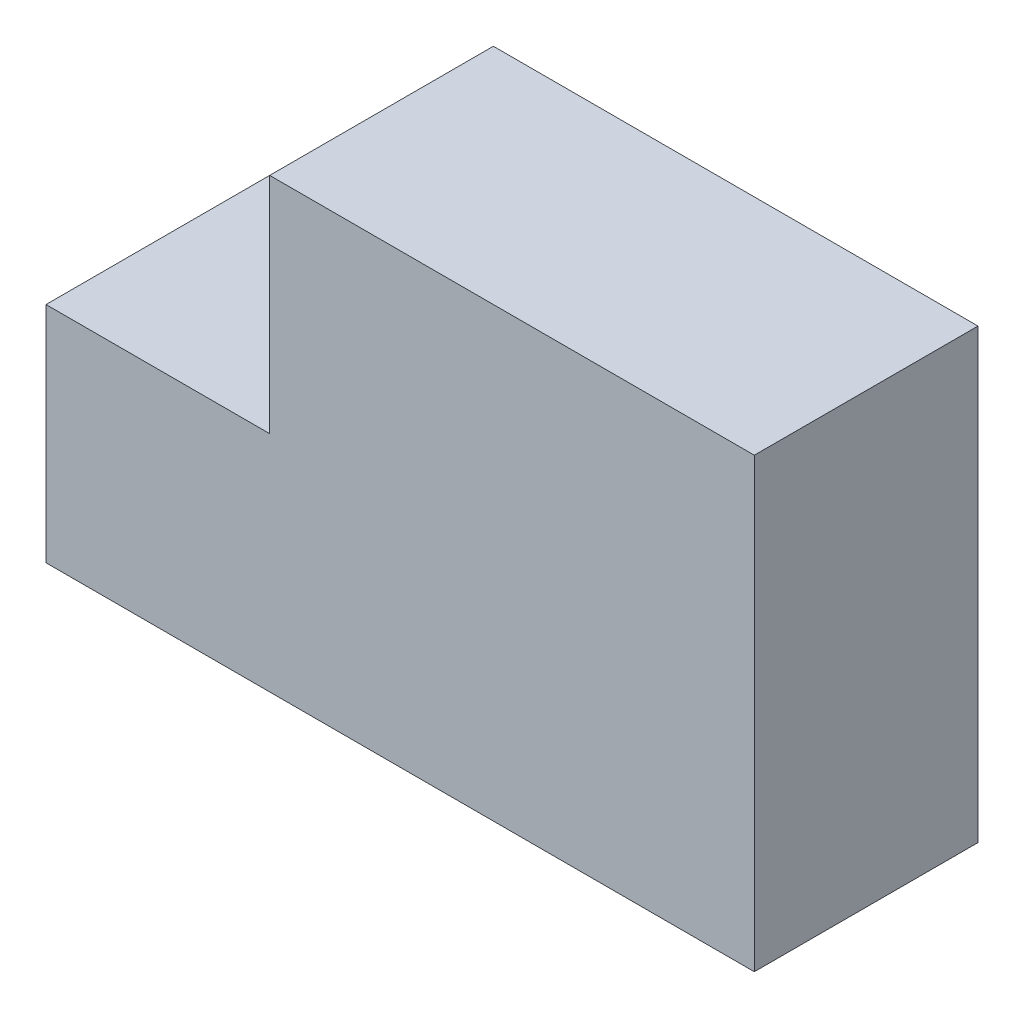
ISO-10303-21;
HEADER;
FILE_DESCRIPTION(('STEP AP214'),'2;1');
FILE_NAME('part.step','',(''),(''),'','','');
FILE_SCHEMA(('AUTOMOTIVE_DESIGN { 1 0 10303 214 1 1 1 1 }'));
ENDSEC;
DATA;
#1=APPLICATION_CONTEXT('core data for automotive mechanical design processes');
#2=APPLICATION_PROTOCOL_DEFINITION('international standard','automotive_design',2000,#1);
#3=PRODUCT_CONTEXT('',#1,'mechanical');
#4=PRODUCT('Part','Part','',(#3));
#5=PRODUCT_RELATED_PRODUCT_CATEGORY('part','',(#4));
#6=PRODUCT_DEFINITION_FORMATION('','',#4);
#7=PRODUCT_DEFINITION_CONTEXT('part definition',#1,'design');
#8=PRODUCT_DEFINITION('design','',#6,#7);
#9=PRODUCT_DEFINITION_SHAPE('','',#8);
#10=(LENGTH_UNIT() NAMED_UNIT(*) SI_UNIT(.MILLI.,.METRE.));
#11=(NAMED_UNIT(*) PLANE_ANGLE_UNIT() SI_UNIT($,.RADIAN.));
#12=(NAMED_UNIT(*) SI_UNIT($,.STERADIAN.) SOLID_ANGLE_UNIT());
#13=UNCERTAINTY_MEASURE_WITH_UNIT(LENGTH_MEASURE(1.E-05),#10,'distance_accuracy_value','');
#14=(GEOMETRIC_REPRESENTATION_CONTEXT(3) GLOBAL_UNCERTAINTY_ASSIGNED_CONTEXT((#13)) GLOBAL_UNIT_ASSIGNED_CONTEXT((#10,
#11,#12)) REPRESENTATION_CONTEXT('',''));
#15=CARTESIAN_POINT('',(0.,0.,0.));
#16=DIRECTION('',(0.,0.,1.));
#17=DIRECTION('',(1.,0.,0.));
#18=AXIS2_PLACEMENT_3D('',#15,#16,#17);
#19=CARTESIAN_POINT('',(19.,0.,6.));
#20=DIRECTION('',(1.,0.,0.));
#21=DIRECTION('',(0.,1.,0.));
#22=AXIS2_PLACEMENT_3D('',#19,#20,#21);
#23=PLANE('',#22);
#24=DIRECTION('',(0.,-1.,0.));
#25=VECTOR('',#24,1.);
#26=CARTESIAN_POINT('',(19.,0.,0.));
#27=LINE('',#26,#25);
#28=CARTESIAN_POINT('',(19.,12.,0.));
#29=VERTEX_POINT('',#28);
#30=CARTESIAN_POINT('',(19.,0.,0.));
#31=VERTEX_POINT('',#30);
#32=EDGE_CURVE('E127',#29,#31,#27,.T.);
#33=ORIENTED_EDGE('',*,*,#32,.F.);
#34=DIRECTION('',(0.,0.,-1.));
#35=VECTOR('',#34,1.);
#36=CARTESIAN_POINT('',(19.,12.,6.));
#37=LINE('',#36,#35);
#38=CARTESIAN_POINT('',(19.,12.,6.));
#39=VERTEX_POINT('',#38);
#40=EDGE_CURVE('E11',#39,#29,#37,.T.);
#41=ORIENTED_EDGE('',*,*,#40,.F.);
#42=DIRECTION('',(0.,-1.,0.));
#43=VECTOR('',#42,1.);
#44=CARTESIAN_POINT('',(19.,0.,6.));
#45=LINE('',#44,#43);
#46=CARTESIAN_POINT('',(19.,0.,6.));
#47=VERTEX_POINT('',#46);
#48=EDGE_CURVE('E147',#39,#47,#45,.T.);
#49=ORIENTED_EDGE('',*,*,#48,.T.);
#50=DIRECTION('',(0.,0.,-1.));
#51=VECTOR('',#50,1.);
#52=CARTESIAN_POINT('',(19.,0.,6.));
#53=LINE('',#52,#51);
#54=EDGE_CURVE('E86',#47,#31,#53,.T.);
#55=ORIENTED_EDGE('',*,*,#54,.T.);
#56=EDGE_LOOP('',(#33,#41,#49,#55));
#57=FACE_BOUND('',#56,.T.);
#58=ADVANCED_FACE('F41',(#57),#23,.T.);
#59=CARTESIAN_POINT('',(0.,12.,6.));
#60=DIRECTION('',(0.,1.,0.));
#61=DIRECTION('',(0.,0.,1.));
#62=AXIS2_PLACEMENT_3D('',#59,#60,#61);
#63=PLANE('',#62);
#64=DIRECTION('',(1.,0.,0.));
#65=VECTOR('',#64,1.);
#66=CARTESIAN_POINT('',(0.,12.,0.));
#67=LINE('',#66,#65);
#68=CARTESIAN_POINT('',(6.,12.,0.));
#69=VERTEX_POINT('',#68);
#70=EDGE_CURVE('E131',#69,#29,#67,.T.);
#71=ORIENTED_EDGE('',*,*,#70,.F.);
#72=DIRECTION('',(0.,0.,-1.));
#73=VECTOR('',#72,1.);
#74=CARTESIAN_POINT('',(6.,12.,6.));
#75=LINE('',#74,#73);
#76=CARTESIAN_POINT('',(6.,12.,6.));
#77=VERTEX_POINT('',#76);
#78=EDGE_CURVE('E50',#77,#69,#75,.T.);
#79=ORIENTED_EDGE('',*,*,#78,.F.);
#80=DIRECTION('',(1.,0.,0.));
#81=VECTOR('',#80,1.);
#82=CARTESIAN_POINT('',(0.,12.,6.));
#83=LINE('',#82,#81);
#84=EDGE_CURVE('E163',#77,#39,#83,.T.);
#85=ORIENTED_EDGE('',*,*,#84,.T.);
#86=ORIENTED_EDGE('',*,*,#40,.T.);
#87=EDGE_LOOP('',(#71,#79,#85,#86));
#88=FACE_BOUND('',#87,.T.);
#89=ADVANCED_FACE('F162',(#88),#63,.T.);
#90=CARTESIAN_POINT('',(6.,0.,6.));
#91=DIRECTION('',(1.,0.,0.));
#92=DIRECTION('',(0.,0.,-1.));
#93=AXIS2_PLACEMENT_3D('',#90,#91,#92);
#94=PLANE('',#93);
#95=DIRECTION('',(0.,-1.,0.));
#96=VECTOR('',#95,1.);
#97=CARTESIAN_POINT('',(6.,0.,0.));
#98=LINE('',#97,#96);
#99=CARTESIAN_POINT('',(6.,6.,0.));
#100=VERTEX_POINT('',#99);
#101=EDGE_CURVE('E135',#69,#100,#98,.T.);
#102=ORIENTED_EDGE('',*,*,#101,.T.);
#103=DIRECTION('',(0.,0.,-1.));
#104=VECTOR('',#103,1.);
#105=CARTESIAN_POINT('',(6.,6.,6.));
#106=LINE('',#105,#104);
#107=CARTESIAN_POINT('',(6.,6.,6.));
#108=VERTEX_POINT('',#107);
#109=EDGE_CURVE('E110',#108,#100,#106,.T.);
#110=ORIENTED_EDGE('',*,*,#109,.F.);
#111=DIRECTION('',(0.,-1.,0.));
#112=VECTOR('',#111,1.);
#113=CARTESIAN_POINT('',(6.,0.,6.));
#114=LINE('',#113,#112);
#115=EDGE_CURVE('E116',#77,#108,#114,.T.);
#116=ORIENTED_EDGE('',*,*,#115,.F.);
#117=ORIENTED_EDGE('',*,*,#78,.T.);
#118=EDGE_LOOP('',(#102,#110,#116,#117));
#119=FACE_BOUND('',#118,.T.);
#120=ADVANCED_FACE('F156',(#119),#94,.F.);
#121=CARTESIAN_POINT('',(0.,6.,6.));
#122=DIRECTION('',(0.,1.,0.));
#123=DIRECTION('',(0.,0.,1.));
#124=AXIS2_PLACEMENT_3D('',#121,#122,#123);
#125=PLANE('',#124);
#126=DIRECTION('',(1.,0.,0.));
#127=VECTOR('',#126,1.);
#128=CARTESIAN_POINT('',(0.,6.,0.));
#129=LINE('',#128,#127);
#130=CARTESIAN_POINT('',(0.,6.,0.));
#131=VERTEX_POINT('',#130);
#132=EDGE_CURVE('E104',#131,#100,#129,.T.);
#133=ORIENTED_EDGE('',*,*,#132,.F.);
#134=DIRECTION('',(0.,0.,-1.));
#135=VECTOR('',#134,1.);
#136=CARTESIAN_POINT('',(0.,6.,6.));
#137=LINE('',#136,#135);
#138=CARTESIAN_POINT('',(0.,6.,6.));
#139=VERTEX_POINT('',#138);
#140=EDGE_CURVE('E99',#139,#131,#137,.T.);
#141=ORIENTED_EDGE('',*,*,#140,.F.);
#142=DIRECTION('',(1.,0.,0.));
#143=VECTOR('',#142,1.);
#144=CARTESIAN_POINT('',(0.,6.,6.));
#145=LINE('',#144,#143);
#146=EDGE_CURVE('E102',#139,#108,#145,.T.);
#147=ORIENTED_EDGE('',*,*,#146,.T.);
#148=ORIENTED_EDGE('',*,*,#109,.T.);
#149=EDGE_LOOP('',(#133,#141,#147,#148));
#150=FACE_BOUND('',#149,.T.);
#151=ADVANCED_FACE('F101',(#150),#125,.T.);
#152=CARTESIAN_POINT('',(0.,0.,6.));
#153=DIRECTION('',(-1.,0.,0.));
#154=DIRECTION('',(0.,-1.,0.));
#155=AXIS2_PLACEMENT_3D('',#152,#153,#154);
#156=PLANE('',#155);
#157=DIRECTION('',(0.,1.,0.));
#158=VECTOR('',#157,1.);
#159=CARTESIAN_POINT('',(0.,0.,0.));
#160=LINE('',#159,#158);
#161=CARTESIAN_POINT('',(0.,0.,0.));
#162=VERTEX_POINT('',#161);
#163=EDGE_CURVE('E141',#162,#131,#160,.T.);
#164=ORIENTED_EDGE('',*,*,#163,.F.);
#165=DIRECTION('',(0.,0.,-1.));
#166=VECTOR('',#165,1.);
#167=CARTESIAN_POINT('',(0.,0.,6.));
#168=LINE('',#167,#166);
#169=CARTESIAN_POINT('',(0.,0.,6.));
#170=VERTEX_POINT('',#169);
#171=EDGE_CURVE('E79',#170,#162,#168,.T.);
#172=ORIENTED_EDGE('',*,*,#171,.F.);
#173=DIRECTION('',(0.,1.,0.));
#174=VECTOR('',#173,1.);
#175=CARTESIAN_POINT('',(0.,0.,6.));
#176=LINE('',#175,#174);
#177=EDGE_CURVE('E113',#170,#139,#176,.T.);
#178=ORIENTED_EDGE('',*,*,#177,.T.);
#179=ORIENTED_EDGE('',*,*,#140,.T.);
#180=EDGE_LOOP('',(#164,#172,#178,#179));
#181=FACE_BOUND('',#180,.T.);
#182=ADVANCED_FACE('F120',(#181),#156,.T.);
#183=CARTESIAN_POINT('',(0.,0.,6.));
#184=DIRECTION('',(0.,1.,0.));
#185=DIRECTION('',(0.,0.,1.));
#186=AXIS2_PLACEMENT_3D('',#183,#184,#185);
#187=PLANE('',#186);
#188=DIRECTION('',(1.,0.,0.));
#189=VECTOR('',#188,1.);
#190=CARTESIAN_POINT('',(0.,0.,0.));
#191=LINE('',#190,#189);
#192=EDGE_CURVE('E144',#162,#31,#191,.T.);
#193=ORIENTED_EDGE('',*,*,#192,.T.);
#194=ORIENTED_EDGE('',*,*,#54,.F.);
#195=DIRECTION('',(1.,0.,0.));
#196=VECTOR('',#195,1.);
#197=CARTESIAN_POINT('',(0.,0.,6.));
#198=LINE('',#197,#196);
#199=EDGE_CURVE('E58',#170,#47,#198,.T.);
#200=ORIENTED_EDGE('',*,*,#199,.F.);
#201=ORIENTED_EDGE('',*,*,#171,.T.);
#202=EDGE_LOOP('',(#193,#194,#200,#201));
#203=FACE_BOUND('',#202,.T.);
#204=ADVANCED_FACE('F164',(#203),#187,.F.);
#205=CARTESIAN_POINT('',(0.,0.,6.));
#206=DIRECTION('',(0.,0.,1.));
#207=DIRECTION('',(1.,0.,0.));
#208=AXIS2_PLACEMENT_3D('',#205,#206,#207);
#209=PLANE('',#208);
#210=ORIENTED_EDGE('',*,*,#48,.F.);
#211=ORIENTED_EDGE('',*,*,#84,.F.);
#212=ORIENTED_EDGE('',*,*,#115,.T.);
#213=ORIENTED_EDGE('',*,*,#146,.F.);
#214=ORIENTED_EDGE('',*,*,#177,.F.);
#215=ORIENTED_EDGE('',*,*,#199,.T.);
#216=EDGE_LOOP('',(#210,#211,#212,#213,#214,#215));
#217=FACE_BOUND('',#216,.T.);
#218=ADVANCED_FACE('F112',(#217),#209,.T.);
#219=CARTESIAN_POINT('',(0.,0.,0.));
#220=DIRECTION('',(0.,0.,1.));
#221=DIRECTION('',(1.,0.,0.));
#222=AXIS2_PLACEMENT_3D('',#219,#220,#221);
#223=PLANE('',#222);
#224=ORIENTED_EDGE('',*,*,#32,.T.);
#225=ORIENTED_EDGE('',*,*,#192,.F.);
#226=ORIENTED_EDGE('',*,*,#163,.T.);
#227=ORIENTED_EDGE('',*,*,#132,.T.);
#228=ORIENTED_EDGE('',*,*,#101,.F.);
#229=ORIENTED_EDGE('',*,*,#70,.T.);
#230=EDGE_LOOP('',(#224,#225,#226,#227,#228,#229));
#231=FACE_BOUND('',#230,.T.);
#232=ADVANCED_FACE('F161',(#231),#223,.F.);
#233=CLOSED_SHELL('',(#58,#89,#120,#151,#182,#204,#218,#232));
#234=MANIFOLD_SOLID_BREP('B2',#233);
#235=ADVANCED_BREP_SHAPE_REPRESENTATION('',(#18,#234),#14);
#236=SHAPE_DEFINITION_REPRESENTATION(#9,#235);
ENDSEC;
END-ISO-10303-21;
